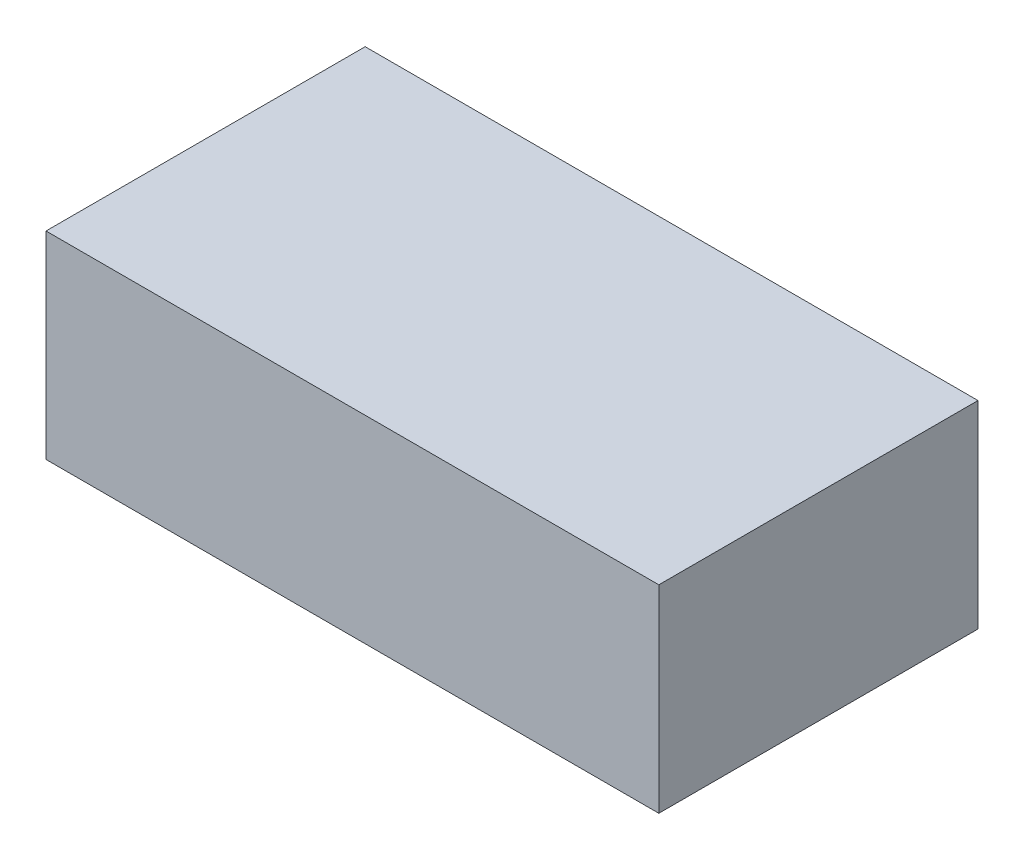
ISO-10303-21;
HEADER;
FILE_DESCRIPTION(('STEP AP214'),'2;1');
FILE_NAME('part.step','',(''),(''),'','','');
FILE_SCHEMA(('AUTOMOTIVE_DESIGN { 1 0 10303 214 1 1 1 1 }'));
ENDSEC;
DATA;
#1=APPLICATION_CONTEXT('core data for automotive mechanical design processes');
#2=APPLICATION_PROTOCOL_DEFINITION('international standard','automotive_design',2000,#1);
#3=PRODUCT_CONTEXT('',#1,'mechanical');
#4=PRODUCT('Part','Part','',(#3));
#5=PRODUCT_RELATED_PRODUCT_CATEGORY('part','',(#4));
#6=PRODUCT_DEFINITION_FORMATION('','',#4);
#7=PRODUCT_DEFINITION_CONTEXT('part definition',#1,'design');
#8=PRODUCT_DEFINITION('design','',#6,#7);
#9=PRODUCT_DEFINITION_SHAPE('','',#8);
#10=(LENGTH_UNIT() NAMED_UNIT(*) SI_UNIT(.MILLI.,.METRE.));
#11=(NAMED_UNIT(*) PLANE_ANGLE_UNIT() SI_UNIT($,.RADIAN.));
#12=(NAMED_UNIT(*) SI_UNIT($,.STERADIAN.) SOLID_ANGLE_UNIT());
#13=UNCERTAINTY_MEASURE_WITH_UNIT(LENGTH_MEASURE(1.E-05),#10,'distance_accuracy_value','');
#14=(GEOMETRIC_REPRESENTATION_CONTEXT(3) GLOBAL_UNCERTAINTY_ASSIGNED_CONTEXT((#13)) GLOBAL_UNIT_ASSIGNED_CONTEXT((#10,
#11,#12)) REPRESENTATION_CONTEXT('',''));
#15=CARTESIAN_POINT('',(0.,0.,0.));
#16=DIRECTION('',(0.,0.,1.));
#17=DIRECTION('',(1.,0.,0.));
#18=AXIS2_PLACEMENT_3D('',#15,#16,#17);
#19=CARTESIAN_POINT('',(-0.48,0.329999999999999,0.5));
#20=DIRECTION('',(1.,0.,0.));
#21=DIRECTION('',(0.,0.,-1.));
#22=AXIS2_PLACEMENT_3D('',#19,#20,#21);
#23=PLANE('',#22);
#24=DIRECTION('',(0.,-1.,0.));
#25=VECTOR('',#24,1.);
#26=CARTESIAN_POINT('',(-0.48,0.329999999999999,0.));
#27=LINE('',#26,#25);
#28=CARTESIAN_POINT('',(-0.48,0.329999999999999,0.));
#29=VERTEX_POINT('',#28);
#30=CARTESIAN_POINT('',(-0.48,0.02,0.));
#31=VERTEX_POINT('',#30);
#32=EDGE_CURVE('E11',#29,#31,#27,.T.);
#33=ORIENTED_EDGE('',*,*,#32,.T.);
#34=DIRECTION('',(0.,0.,-1.));
#35=VECTOR('',#34,1.);
#36=CARTESIAN_POINT('',(-0.48,0.02,0.5));
#37=LINE('',#36,#35);
#38=CARTESIAN_POINT('',(-0.48,0.02,0.5));
#39=VERTEX_POINT('',#38);
#40=EDGE_CURVE('E23',#39,#31,#37,.T.);
#41=ORIENTED_EDGE('',*,*,#40,.F.);
#42=DIRECTION('',(0.,-1.,0.));
#43=VECTOR('',#42,1.);
#44=CARTESIAN_POINT('',(-0.48,0.329999999999999,0.5));
#45=LINE('',#44,#43);
#46=CARTESIAN_POINT('',(-0.48,0.329999999999999,0.5));
#47=VERTEX_POINT('',#46);
#48=EDGE_CURVE('E87',#47,#39,#45,.T.);
#49=ORIENTED_EDGE('',*,*,#48,.F.);
#50=DIRECTION('',(0.,0.,-1.));
#51=VECTOR('',#50,1.);
#52=CARTESIAN_POINT('',(-0.48,0.329999999999999,0.5));
#53=LINE('',#52,#51);
#54=EDGE_CURVE('E76',#47,#29,#53,.T.);
#55=ORIENTED_EDGE('',*,*,#54,.T.);
#56=EDGE_LOOP('',(#33,#41,#49,#55));
#57=FACE_BOUND('',#56,.T.);
#58=ADVANCED_FACE('F16',(#57),#23,.F.);
#59=CARTESIAN_POINT('',(-0.48,0.02,0.5));
#60=DIRECTION('',(0.,1.,0.));
#61=DIRECTION('',(0.,0.,1.));
#62=AXIS2_PLACEMENT_3D('',#59,#60,#61);
#63=PLANE('',#62);
#64=DIRECTION('',(1.,0.,0.));
#65=VECTOR('',#64,1.);
#66=CARTESIAN_POINT('',(-0.48,0.02,0.));
#67=LINE('',#66,#65);
#68=CARTESIAN_POINT('',(0.48,0.02,0.));
#69=VERTEX_POINT('',#68);
#70=EDGE_CURVE('E84',#31,#69,#67,.T.);
#71=ORIENTED_EDGE('',*,*,#70,.T.);
#72=DIRECTION('',(0.,0.,-1.));
#73=VECTOR('',#72,1.);
#74=CARTESIAN_POINT('',(0.48,0.02,0.5));
#75=LINE('',#74,#73);
#76=CARTESIAN_POINT('',(0.48,0.02,0.5));
#77=VERTEX_POINT('',#76);
#78=EDGE_CURVE('E82',#77,#69,#75,.T.);
#79=ORIENTED_EDGE('',*,*,#78,.F.);
#80=DIRECTION('',(1.,0.,0.));
#81=VECTOR('',#80,1.);
#82=CARTESIAN_POINT('',(-0.48,0.02,0.5));
#83=LINE('',#82,#81);
#84=EDGE_CURVE('E71',#39,#77,#83,.T.);
#85=ORIENTED_EDGE('',*,*,#84,.F.);
#86=ORIENTED_EDGE('',*,*,#40,.T.);
#87=EDGE_LOOP('',(#71,#79,#85,#86));
#88=FACE_BOUND('',#87,.T.);
#89=ADVANCED_FACE('F89',(#88),#63,.F.);
#90=CARTESIAN_POINT('',(0.48,0.329999999999999,0.5));
#91=DIRECTION('',(-1.,0.,0.));
#92=DIRECTION('',(0.,0.,1.));
#93=AXIS2_PLACEMENT_3D('',#90,#91,#92);
#94=PLANE('',#93);
#95=DIRECTION('',(0.,1.,0.));
#96=VECTOR('',#95,1.);
#97=CARTESIAN_POINT('',(0.48,0.329999999999999,0.));
#98=LINE('',#97,#96);
#99=CARTESIAN_POINT('',(0.48,0.329999999999999,0.));
#100=VERTEX_POINT('',#99);
#101=EDGE_CURVE('E59',#69,#100,#98,.T.);
#102=ORIENTED_EDGE('',*,*,#101,.T.);
#103=DIRECTION('',(0.,0.,-1.));
#104=VECTOR('',#103,1.);
#105=CARTESIAN_POINT('',(0.48,0.329999999999999,0.5));
#106=LINE('',#105,#104);
#107=CARTESIAN_POINT('',(0.48,0.329999999999999,0.5));
#108=VERTEX_POINT('',#107);
#109=EDGE_CURVE('E53',#108,#100,#106,.T.);
#110=ORIENTED_EDGE('',*,*,#109,.F.);
#111=DIRECTION('',(0.,1.,0.));
#112=VECTOR('',#111,1.);
#113=CARTESIAN_POINT('',(0.48,0.329999999999999,0.5));
#114=LINE('',#113,#112);
#115=EDGE_CURVE('E57',#77,#108,#114,.T.);
#116=ORIENTED_EDGE('',*,*,#115,.F.);
#117=ORIENTED_EDGE('',*,*,#78,.T.);
#118=EDGE_LOOP('',(#102,#110,#116,#117));
#119=FACE_BOUND('',#118,.T.);
#120=ADVANCED_FACE('F55',(#119),#94,.F.);
#121=CARTESIAN_POINT('',(-0.48,0.329999999999999,0.5));
#122=DIRECTION('',(0.,-1.,0.));
#123=DIRECTION('',(0.,0.,-1.));
#124=AXIS2_PLACEMENT_3D('',#121,#122,#123);
#125=PLANE('',#124);
#126=DIRECTION('',(-1.,0.,0.));
#127=VECTOR('',#126,1.);
#128=CARTESIAN_POINT('',(-0.48,0.329999999999999,0.));
#129=LINE('',#128,#127);
#130=EDGE_CURVE('E72',#100,#29,#129,.T.);
#131=ORIENTED_EDGE('',*,*,#130,.T.);
#132=ORIENTED_EDGE('',*,*,#54,.F.);
#133=DIRECTION('',(-1.,0.,0.));
#134=VECTOR('',#133,1.);
#135=CARTESIAN_POINT('',(-0.48,0.329999999999999,0.5));
#136=LINE('',#135,#134);
#137=EDGE_CURVE('E69',#108,#47,#136,.T.);
#138=ORIENTED_EDGE('',*,*,#137,.F.);
#139=ORIENTED_EDGE('',*,*,#109,.T.);
#140=EDGE_LOOP('',(#131,#132,#138,#139));
#141=FACE_BOUND('',#140,.T.);
#142=ADVANCED_FACE('F75',(#141),#125,.F.);
#143=CARTESIAN_POINT('',(-0.48,0.02,0.5));
#144=DIRECTION('',(0.,0.,1.));
#145=DIRECTION('',(1.,0.,0.));
#146=AXIS2_PLACEMENT_3D('',#143,#144,#145);
#147=PLANE('',#146);
#148=ORIENTED_EDGE('',*,*,#48,.T.);
#149=ORIENTED_EDGE('',*,*,#84,.T.);
#150=ORIENTED_EDGE('',*,*,#115,.T.);
#151=ORIENTED_EDGE('',*,*,#137,.T.);
#152=EDGE_LOOP('',(#148,#149,#150,#151));
#153=FACE_BOUND('',#152,.T.);
#154=ADVANCED_FACE('F68',(#153),#147,.T.);
#155=CARTESIAN_POINT('',(-0.48,0.02,0.));
#156=DIRECTION('',(0.,0.,1.));
#157=DIRECTION('',(1.,0.,0.));
#158=AXIS2_PLACEMENT_3D('',#155,#156,#157);
#159=PLANE('',#158);
#160=ORIENTED_EDGE('',*,*,#32,.F.);
#161=ORIENTED_EDGE('',*,*,#130,.F.);
#162=ORIENTED_EDGE('',*,*,#101,.F.);
#163=ORIENTED_EDGE('',*,*,#70,.F.);
#164=EDGE_LOOP('',(#160,#161,#162,#163));
#165=FACE_BOUND('',#164,.T.);
#166=ADVANCED_FACE('F90',(#165),#159,.F.);
#167=CLOSED_SHELL('',(#58,#89,#120,#142,#154,#166));
#168=MANIFOLD_SOLID_BREP('B1',#167);
#169=ADVANCED_BREP_SHAPE_REPRESENTATION('',(#18,#168),#14);
#170=SHAPE_DEFINITION_REPRESENTATION(#9,#169);
ENDSEC;
END-ISO-10303-21;
